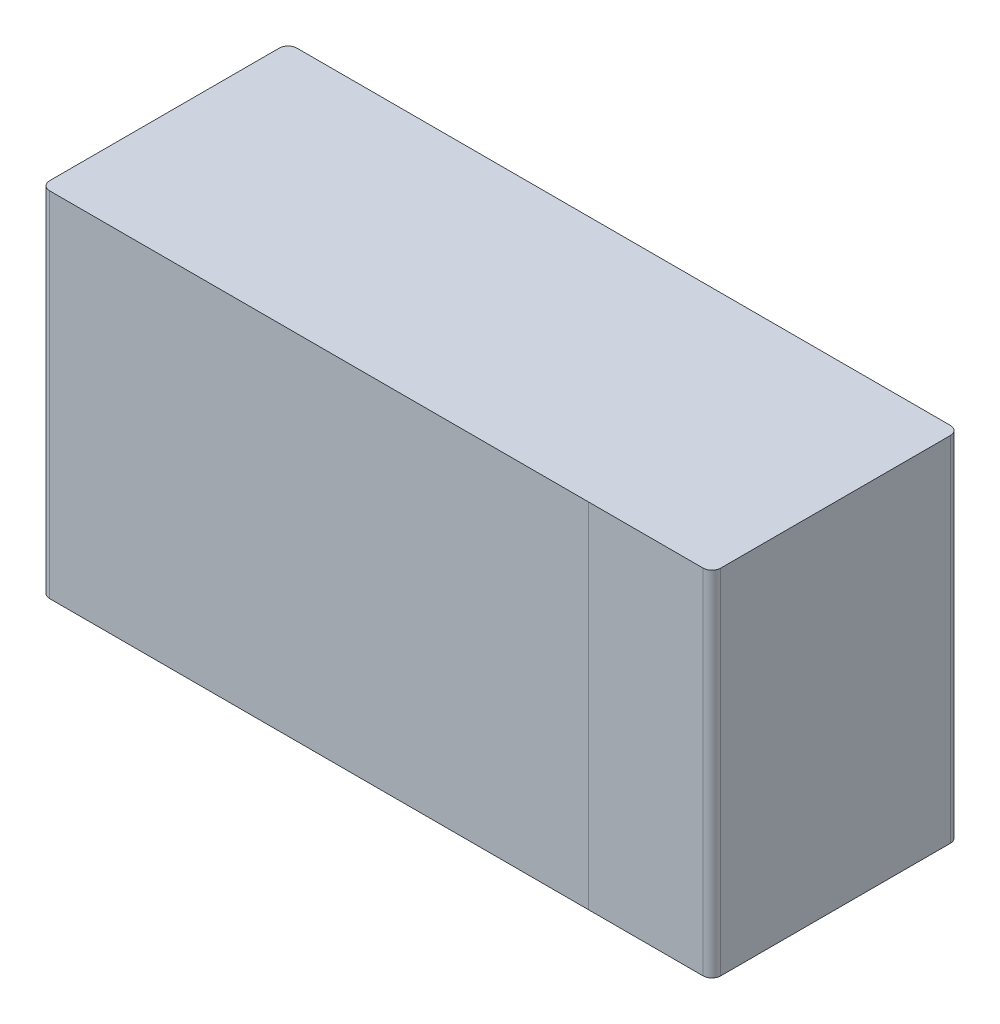
ISO-10303-21;
HEADER;
FILE_DESCRIPTION(('STEP AP214'),'2;1');
FILE_NAME('part.step','',(''),(''),'','','');
FILE_SCHEMA(('AUTOMOTIVE_DESIGN { 1 0 10303 214 1 1 1 1 }'));
ENDSEC;
DATA;
#1=APPLICATION_CONTEXT('core data for automotive mechanical design processes');
#2=APPLICATION_PROTOCOL_DEFINITION('international standard','automotive_design',2000,#1);
#3=PRODUCT_CONTEXT('',#1,'mechanical');
#4=PRODUCT('Part','Part','',(#3));
#5=PRODUCT_RELATED_PRODUCT_CATEGORY('part','',(#4));
#6=PRODUCT_DEFINITION_FORMATION('','',#4);
#7=PRODUCT_DEFINITION_CONTEXT('part definition',#1,'design');
#8=PRODUCT_DEFINITION('design','',#6,#7);
#9=PRODUCT_DEFINITION_SHAPE('','',#8);
#10=(LENGTH_UNIT() NAMED_UNIT(*) SI_UNIT(.MILLI.,.METRE.));
#11=(NAMED_UNIT(*) PLANE_ANGLE_UNIT() SI_UNIT($,.RADIAN.));
#12=(NAMED_UNIT(*) SI_UNIT($,.STERADIAN.) SOLID_ANGLE_UNIT());
#13=UNCERTAINTY_MEASURE_WITH_UNIT(LENGTH_MEASURE(1.E-05),#10,'distance_accuracy_value','');
#14=(GEOMETRIC_REPRESENTATION_CONTEXT(3) GLOBAL_UNCERTAINTY_ASSIGNED_CONTEXT((#13)) GLOBAL_UNIT_ASSIGNED_CONTEXT((#10,
#11,#12)) REPRESENTATION_CONTEXT('',''));
#15=CARTESIAN_POINT('',(0.,0.,0.));
#16=DIRECTION('',(0.,0.,1.));
#17=DIRECTION('',(1.,0.,0.));
#18=AXIS2_PLACEMENT_3D('',#15,#16,#17);
#19=CARTESIAN_POINT('',(0.,-0.25,0.200000000020373));
#20=DIRECTION('',(0.,1.,0.));
#21=DIRECTION('',(0.,0.,1.));
#22=AXIS2_PLACEMENT_3D('',#19,#20,#21);
#23=PLANE('',#22);
#24=DIRECTION('',(-1.,0.,4.85066847799587E-11));
#25=VECTOR('',#24,1.);
#26=CARTESIAN_POINT('',(-0.3,-0.25,0.375000000029104));
#27=LINE('',#26,#25);
#28=CARTESIAN_POINT('',(0.3,-0.25,0.375));
#29=VERTEX_POINT('',#28);
#30=CARTESIAN_POINT('',(-0.46250000000291,-0.25,0.375000000029104));
#31=VERTEX_POINT('',#30);
#32=EDGE_CURVE('E11',#29,#31,#27,.T.);
#33=ORIENTED_EDGE('',*,*,#32,.T.);
#34=CARTESIAN_POINT('',(-0.46250000000291,-0.25,0.362500000029104));
#35=DIRECTION('',(0.,-1.,0.));
#36=DIRECTION('',(-1.,0.,0.));
#37=AXIS2_PLACEMENT_3D('',#34,#35,#36);
#38=CIRCLE('',#37,0.0125);
#39=CARTESIAN_POINT('',(-0.47500000000291,-0.25,0.362500000029104));
#40=VERTEX_POINT('',#39);
#41=EDGE_CURVE('E24',#31,#40,#38,.T.);
#42=ORIENTED_EDGE('',*,*,#41,.T.);
#43=DIRECTION('',(0.,0.,-1.));
#44=VECTOR('',#43,1.);
#45=CARTESIAN_POINT('',(-0.47500000000291,-0.25,0.0375000000116415));
#46=LINE('',#45,#44);
#47=CARTESIAN_POINT('',(-0.47500000000291,-0.25,0.0375000000116415));
#48=VERTEX_POINT('',#47);
#49=EDGE_CURVE('E155',#40,#48,#46,.T.);
#50=ORIENTED_EDGE('',*,*,#49,.T.);
#51=CARTESIAN_POINT('',(-0.46250000000291,-0.25,0.0375000000116415));
#52=DIRECTION('',(0.,-1.,0.));
#53=DIRECTION('',(0.,0.,-1.));
#54=AXIS2_PLACEMENT_3D('',#51,#52,#53);
#55=CIRCLE('',#54,0.0125);
#56=CARTESIAN_POINT('',(-0.46250000000291,-0.25,0.0250000000116415));
#57=VERTEX_POINT('',#56);
#58=EDGE_CURVE('E153',#48,#57,#55,.T.);
#59=ORIENTED_EDGE('',*,*,#58,.T.);
#60=DIRECTION('',(1.,0.,0.));
#61=VECTOR('',#60,1.);
#62=CARTESIAN_POINT('',(-0.25,-0.25,0.0250000000116414));
#63=LINE('',#62,#61);
#64=CARTESIAN_POINT('',(0.46250000000291,-0.25,0.0250000000116413));
#65=VERTEX_POINT('',#64);
#66=EDGE_CURVE('E151',#57,#65,#63,.T.);
#67=ORIENTED_EDGE('',*,*,#66,.T.);
#68=CARTESIAN_POINT('',(0.46250000000291,-0.25,0.0375000000116413));
#69=DIRECTION('',(0.,-1.,0.));
#70=DIRECTION('',(1.,0.,0.));
#71=AXIS2_PLACEMENT_3D('',#68,#69,#70);
#72=CIRCLE('',#71,0.0125);
#73=CARTESIAN_POINT('',(0.47500000000291,-0.25,0.0375000000116413));
#74=VERTEX_POINT('',#73);
#75=EDGE_CURVE('E149',#65,#74,#72,.T.);
#76=ORIENTED_EDGE('',*,*,#75,.T.);
#77=DIRECTION('',(0.,0.,1.));
#78=VECTOR('',#77,1.);
#79=CARTESIAN_POINT('',(0.47500000000291,-0.25,0.362500000029104));
#80=LINE('',#79,#78);
#81=CARTESIAN_POINT('',(0.47500000000291,-0.25,0.362500000029104));
#82=VERTEX_POINT('',#81);
#83=EDGE_CURVE('E147',#74,#82,#80,.T.);
#84=ORIENTED_EDGE('',*,*,#83,.T.);
#85=CARTESIAN_POINT('',(0.46250000000291,-0.25,0.362500000029104));
#86=DIRECTION('',(0.,-1.,0.));
#87=DIRECTION('',(0.,0.,1.));
#88=AXIS2_PLACEMENT_3D('',#85,#86,#87);
#89=CIRCLE('',#88,0.0125);
#90=CARTESIAN_POINT('',(0.46250000000291,-0.25,0.375000000029104));
#91=VERTEX_POINT('',#90);
#92=EDGE_CURVE('E145',#82,#91,#89,.T.);
#93=ORIENTED_EDGE('',*,*,#92,.T.);
#94=DIRECTION('',(-1.,0.,-1.79100751320467E-10));
#95=VECTOR('',#94,1.);
#96=CARTESIAN_POINT('',(0.3,-0.25,0.375));
#97=LINE('',#96,#95);
#98=EDGE_CURVE('E143',#91,#29,#97,.T.);
#99=ORIENTED_EDGE('',*,*,#98,.T.);
#100=EDGE_LOOP('',(#33,#42,#50,#59,#67,#76,#84,#93,#99));
#101=FACE_BOUND('',#100,.T.);
#102=ADVANCED_FACE('F17',(#101),#23,.F.);
#103=CARTESIAN_POINT('',(-0.46250000000291,0.,0.362500000029104));
#104=DIRECTION('',(0.,1.,0.));
#105=DIRECTION('',(-1.,0.,0.));
#106=AXIS2_PLACEMENT_3D('',#103,#104,#105);
#107=CYLINDRICAL_SURFACE('',#106,0.0125);
#108=DIRECTION('',(0.,-1.,0.));
#109=VECTOR('',#108,1.);
#110=CARTESIAN_POINT('',(-0.46250000000291,0.,0.375000000029104));
#111=LINE('',#110,#109);
#112=CARTESIAN_POINT('',(-0.46250000000291,0.25,0.375000000029104));
#113=VERTEX_POINT('',#112);
#114=EDGE_CURVE('E141',#113,#31,#111,.T.);
#115=ORIENTED_EDGE('',*,*,#114,.F.);
#116=CARTESIAN_POINT('',(-0.46250000000291,0.25,0.362500000029104));
#117=DIRECTION('',(0.,1.,0.));
#118=DIRECTION('',(-1.,0.,0.));
#119=AXIS2_PLACEMENT_3D('',#116,#117,#118);
#120=CIRCLE('',#119,0.0125);
#121=CARTESIAN_POINT('',(-0.47500000000291,0.25,0.362500000029104));
#122=VERTEX_POINT('',#121);
#123=EDGE_CURVE('E102',#122,#113,#120,.T.);
#124=ORIENTED_EDGE('',*,*,#123,.F.);
#125=DIRECTION('',(0.,1.,0.));
#126=VECTOR('',#125,1.);
#127=CARTESIAN_POINT('',(-0.47500000000291,0.,0.362500000029104));
#128=LINE('',#127,#126);
#129=EDGE_CURVE('E137',#40,#122,#128,.T.);
#130=ORIENTED_EDGE('',*,*,#129,.F.);
#131=ORIENTED_EDGE('',*,*,#41,.F.);
#132=EDGE_LOOP('',(#115,#124,#130,#131));
#133=FACE_BOUND('',#132,.T.);
#134=ADVANCED_FACE('F163',(#133),#107,.T.);
#135=CARTESIAN_POINT('',(-0.47500000000291,0.,0.0375000000116415));
#136=DIRECTION('',(-1.,0.,0.));
#137=DIRECTION('',(0.,0.,1.));
#138=AXIS2_PLACEMENT_3D('',#135,#136,#137);
#139=PLANE('',#138);
#140=ORIENTED_EDGE('',*,*,#129,.T.);
#141=DIRECTION('',(0.,0.,1.));
#142=VECTOR('',#141,1.);
#143=CARTESIAN_POINT('',(-0.47500000000291,0.25,0.0375000000116415));
#144=LINE('',#143,#142);
#145=CARTESIAN_POINT('',(-0.47500000000291,0.25,0.0375000000116415));
#146=VERTEX_POINT('',#145);
#147=EDGE_CURVE('E135',#146,#122,#144,.T.);
#148=ORIENTED_EDGE('',*,*,#147,.F.);
#149=DIRECTION('',(0.,1.,0.));
#150=VECTOR('',#149,1.);
#151=CARTESIAN_POINT('',(-0.47500000000291,0.,0.0375000000116415));
#152=LINE('',#151,#150);
#153=EDGE_CURVE('E132',#48,#146,#152,.T.);
#154=ORIENTED_EDGE('',*,*,#153,.F.);
#155=ORIENTED_EDGE('',*,*,#49,.F.);
#156=EDGE_LOOP('',(#140,#148,#154,#155));
#157=FACE_BOUND('',#156,.T.);
#158=ADVANCED_FACE('F162',(#157),#139,.T.);
#159=CARTESIAN_POINT('',(-0.46250000000291,0.,0.0375000000116415));
#160=DIRECTION('',(0.,1.,0.));
#161=DIRECTION('',(0.,0.,-1.));
#162=AXIS2_PLACEMENT_3D('',#159,#160,#161);
#163=CYLINDRICAL_SURFACE('',#162,0.0125);
#164=ORIENTED_EDGE('',*,*,#153,.T.);
#165=CARTESIAN_POINT('',(-0.46250000000291,0.25,0.0375000000116415));
#166=DIRECTION('',(0.,1.,0.));
#167=DIRECTION('',(0.,0.,-1.));
#168=AXIS2_PLACEMENT_3D('',#165,#166,#167);
#169=CIRCLE('',#168,0.0125);
#170=CARTESIAN_POINT('',(-0.46250000000291,0.25,0.0250000000116415));
#171=VERTEX_POINT('',#170);
#172=EDGE_CURVE('E129',#171,#146,#169,.T.);
#173=ORIENTED_EDGE('',*,*,#172,.F.);
#174=DIRECTION('',(0.,1.,0.));
#175=VECTOR('',#174,1.);
#176=CARTESIAN_POINT('',(-0.46250000000291,0.,0.0250000000116415));
#177=LINE('',#176,#175);
#178=EDGE_CURVE('E126',#57,#171,#177,.T.);
#179=ORIENTED_EDGE('',*,*,#178,.F.);
#180=ORIENTED_EDGE('',*,*,#58,.F.);
#181=EDGE_LOOP('',(#164,#173,#179,#180));
#182=FACE_BOUND('',#181,.T.);
#183=ADVANCED_FACE('F170',(#182),#163,.T.);
#184=CARTESIAN_POINT('',(0.46250000000291,0.,0.0250000000116412));
#185=DIRECTION('',(0.,0.,-1.));
#186=DIRECTION('',(-1.,0.,0.));
#187=AXIS2_PLACEMENT_3D('',#184,#185,#186);
#188=PLANE('',#187);
#189=ORIENTED_EDGE('',*,*,#178,.T.);
#190=DIRECTION('',(-1.,0.,0.));
#191=VECTOR('',#190,1.);
#192=CARTESIAN_POINT('',(-0.25,0.25,0.0250000000116414));
#193=LINE('',#192,#191);
#194=CARTESIAN_POINT('',(0.46250000000291,0.25,0.0250000000116413));
#195=VERTEX_POINT('',#194);
#196=EDGE_CURVE('E123',#195,#171,#193,.T.);
#197=ORIENTED_EDGE('',*,*,#196,.F.);
#198=DIRECTION('',(0.,1.,0.));
#199=VECTOR('',#198,1.);
#200=CARTESIAN_POINT('',(0.46250000000291,0.,0.0250000000116413));
#201=LINE('',#200,#199);
#202=EDGE_CURVE('E120',#65,#195,#201,.T.);
#203=ORIENTED_EDGE('',*,*,#202,.F.);
#204=ORIENTED_EDGE('',*,*,#66,.F.);
#205=EDGE_LOOP('',(#189,#197,#203,#204));
#206=FACE_BOUND('',#205,.T.);
#207=ADVANCED_FACE('F175',(#206),#188,.T.);
#208=CARTESIAN_POINT('',(0.46250000000291,0.,0.0375000000116413));
#209=DIRECTION('',(0.,1.,0.));
#210=DIRECTION('',(1.,0.,0.));
#211=AXIS2_PLACEMENT_3D('',#208,#209,#210);
#212=CYLINDRICAL_SURFACE('',#211,0.0125);
#213=ORIENTED_EDGE('',*,*,#202,.T.);
#214=CARTESIAN_POINT('',(0.46250000000291,0.25,0.0375000000116413));
#215=DIRECTION('',(0.,1.,0.));
#216=DIRECTION('',(1.,0.,0.));
#217=AXIS2_PLACEMENT_3D('',#214,#215,#216);
#218=CIRCLE('',#217,0.0125);
#219=CARTESIAN_POINT('',(0.47500000000291,0.25,0.0375000000116413));
#220=VERTEX_POINT('',#219);
#221=EDGE_CURVE('E117',#220,#195,#218,.T.);
#222=ORIENTED_EDGE('',*,*,#221,.F.);
#223=DIRECTION('',(0.,1.,0.));
#224=VECTOR('',#223,1.);
#225=CARTESIAN_POINT('',(0.47500000000291,0.,0.0375000000116413));
#226=LINE('',#225,#224);
#227=EDGE_CURVE('E114',#74,#220,#226,.T.);
#228=ORIENTED_EDGE('',*,*,#227,.F.);
#229=ORIENTED_EDGE('',*,*,#75,.F.);
#230=EDGE_LOOP('',(#213,#222,#228,#229));
#231=FACE_BOUND('',#230,.T.);
#232=ADVANCED_FACE('F179',(#231),#212,.T.);
#233=CARTESIAN_POINT('',(0.47500000000291,0.,0.362500000029104));
#234=DIRECTION('',(1.,0.,0.));
#235=DIRECTION('',(0.,0.,-1.));
#236=AXIS2_PLACEMENT_3D('',#233,#234,#235);
#237=PLANE('',#236);
#238=ORIENTED_EDGE('',*,*,#227,.T.);
#239=DIRECTION('',(0.,0.,-1.));
#240=VECTOR('',#239,1.);
#241=CARTESIAN_POINT('',(0.47500000000291,0.25,0.362500000029104));
#242=LINE('',#241,#240);
#243=CARTESIAN_POINT('',(0.47500000000291,0.25,0.362500000029104));
#244=VERTEX_POINT('',#243);
#245=EDGE_CURVE('E111',#244,#220,#242,.T.);
#246=ORIENTED_EDGE('',*,*,#245,.F.);
#247=DIRECTION('',(0.,1.,0.));
#248=VECTOR('',#247,1.);
#249=CARTESIAN_POINT('',(0.47500000000291,0.,0.362500000029104));
#250=LINE('',#249,#248);
#251=EDGE_CURVE('E108',#82,#244,#250,.T.);
#252=ORIENTED_EDGE('',*,*,#251,.F.);
#253=ORIENTED_EDGE('',*,*,#83,.F.);
#254=EDGE_LOOP('',(#238,#246,#252,#253));
#255=FACE_BOUND('',#254,.T.);
#256=ADVANCED_FACE('F183',(#255),#237,.T.);
#257=CARTESIAN_POINT('',(0.46250000000291,0.,0.362500000029104));
#258=DIRECTION('',(0.,1.,0.));
#259=DIRECTION('',(0.,0.,1.));
#260=AXIS2_PLACEMENT_3D('',#257,#258,#259);
#261=CYLINDRICAL_SURFACE('',#260,0.0125);
#262=ORIENTED_EDGE('',*,*,#251,.T.);
#263=CARTESIAN_POINT('',(0.46250000000291,0.25,0.362500000029104));
#264=DIRECTION('',(0.,1.,0.));
#265=DIRECTION('',(0.,0.,1.));
#266=AXIS2_PLACEMENT_3D('',#263,#264,#265);
#267=CIRCLE('',#266,0.0125);
#268=CARTESIAN_POINT('',(0.46250000000291,0.25,0.375000000029104));
#269=VERTEX_POINT('',#268);
#270=EDGE_CURVE('E106',#269,#244,#267,.T.);
#271=ORIENTED_EDGE('',*,*,#270,.F.);
#272=DIRECTION('',(0.,1.,0.));
#273=VECTOR('',#272,1.);
#274=CARTESIAN_POINT('',(0.46250000000291,0.,0.375000000029104));
#275=LINE('',#274,#273);
#276=EDGE_CURVE('E90',#91,#269,#275,.T.);
#277=ORIENTED_EDGE('',*,*,#276,.F.);
#278=ORIENTED_EDGE('',*,*,#92,.F.);
#279=EDGE_LOOP('',(#262,#271,#277,#278));
#280=FACE_BOUND('',#279,.T.);
#281=ADVANCED_FACE('F187',(#280),#261,.T.);
#282=CARTESIAN_POINT('',(0.3,0.,0.375));
#283=DIRECTION('',(-1.79100751320467E-10,0.,1.));
#284=DIRECTION('',(1.,0.,1.79100751320467E-10));
#285=AXIS2_PLACEMENT_3D('',#282,#283,#284);
#286=PLANE('',#285);
#287=ORIENTED_EDGE('',*,*,#276,.T.);
#288=DIRECTION('',(1.,0.,1.79100751320467E-10));
#289=VECTOR('',#288,1.);
#290=CARTESIAN_POINT('',(0.3,0.25,0.375));
#291=LINE('',#290,#289);
#292=CARTESIAN_POINT('',(0.3,0.25,0.375));
#293=VERTEX_POINT('',#292);
#294=EDGE_CURVE('E85',#293,#269,#291,.T.);
#295=ORIENTED_EDGE('',*,*,#294,.F.);
#296=DIRECTION('',(0.,1.,0.));
#297=VECTOR('',#296,1.);
#298=CARTESIAN_POINT('',(0.3,0.,0.375));
#299=LINE('',#298,#297);
#300=EDGE_CURVE('E88',#29,#293,#299,.T.);
#301=ORIENTED_EDGE('',*,*,#300,.F.);
#302=ORIENTED_EDGE('',*,*,#98,.F.);
#303=EDGE_LOOP('',(#287,#295,#301,#302));
#304=FACE_BOUND('',#303,.T.);
#305=ADVANCED_FACE('F86',(#304),#286,.T.);
#306=CARTESIAN_POINT('',(-0.46250000000291,0.,0.375000000036986));
#307=DIRECTION('',(4.85066847799587E-11,0.,1.));
#308=DIRECTION('',(1.,0.,-4.85066847799587E-11));
#309=AXIS2_PLACEMENT_3D('',#306,#307,#308);
#310=PLANE('',#309);
#311=ORIENTED_EDGE('',*,*,#300,.T.);
#312=DIRECTION('',(1.,0.,-4.85066847799587E-11));
#313=VECTOR('',#312,1.);
#314=CARTESIAN_POINT('',(-0.3,0.25,0.375000000029104));
#315=LINE('',#314,#313);
#316=EDGE_CURVE('E97',#113,#293,#315,.T.);
#317=ORIENTED_EDGE('',*,*,#316,.F.);
#318=ORIENTED_EDGE('',*,*,#114,.T.);
#319=ORIENTED_EDGE('',*,*,#32,.F.);
#320=EDGE_LOOP('',(#311,#317,#318,#319));
#321=FACE_BOUND('',#320,.T.);
#322=ADVANCED_FACE('F96',(#321),#310,.T.);
#323=CARTESIAN_POINT('',(0.,0.25,0.200000000020373));
#324=DIRECTION('',(0.,1.,0.));
#325=DIRECTION('',(0.,0.,1.));
#326=AXIS2_PLACEMENT_3D('',#323,#324,#325);
#327=PLANE('',#326);
#328=ORIENTED_EDGE('',*,*,#316,.T.);
#329=ORIENTED_EDGE('',*,*,#294,.T.);
#330=ORIENTED_EDGE('',*,*,#270,.T.);
#331=ORIENTED_EDGE('',*,*,#245,.T.);
#332=ORIENTED_EDGE('',*,*,#221,.T.);
#333=ORIENTED_EDGE('',*,*,#196,.T.);
#334=ORIENTED_EDGE('',*,*,#172,.T.);
#335=ORIENTED_EDGE('',*,*,#147,.T.);
#336=ORIENTED_EDGE('',*,*,#123,.T.);
#337=EDGE_LOOP('',(#328,#329,#330,#331,#332,#333,#334,#335,#336));
#338=FACE_BOUND('',#337,.T.);
#339=ADVANCED_FACE('F100',(#338),#327,.T.);
#340=CLOSED_SHELL('',(#102,#134,#158,#183,#207,#232,#256,#281,#305,#322,#339));
#341=MANIFOLD_SOLID_BREP('B1',#340);
#342=ADVANCED_BREP_SHAPE_REPRESENTATION('',(#18,#341),#14);
#343=SHAPE_DEFINITION_REPRESENTATION(#9,#342);
ENDSEC;
END-ISO-10303-21;
